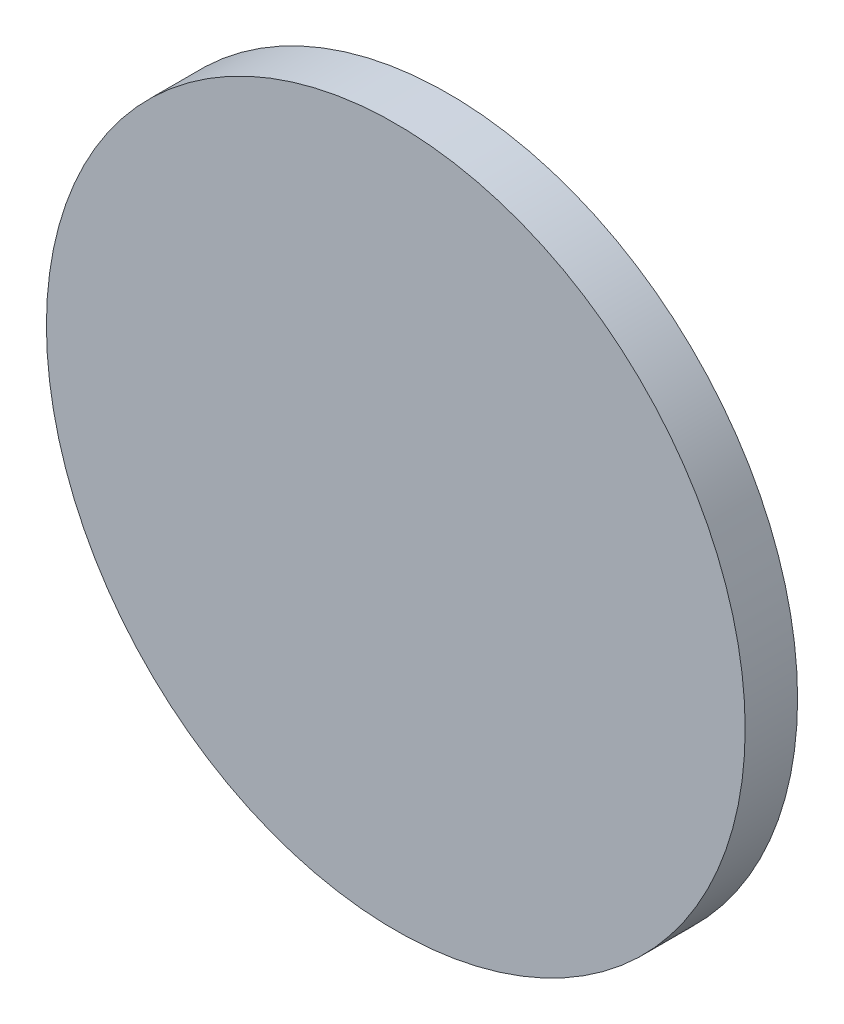
ISO-10303-21;
HEADER;
FILE_DESCRIPTION(('STEP AP214'),'2;1');
FILE_NAME('part.step','',(''),(''),'','','');
FILE_SCHEMA(('AUTOMOTIVE_DESIGN { 1 0 10303 214 1 1 1 1 }'));
ENDSEC;
DATA;
#1=APPLICATION_CONTEXT('core data for automotive mechanical design processes');
#2=APPLICATION_PROTOCOL_DEFINITION('international standard','automotive_design',2000,#1);
#3=PRODUCT_CONTEXT('',#1,'mechanical');
#4=PRODUCT('Part','Part','',(#3));
#5=PRODUCT_RELATED_PRODUCT_CATEGORY('part','',(#4));
#6=PRODUCT_DEFINITION_FORMATION('','',#4);
#7=PRODUCT_DEFINITION_CONTEXT('part definition',#1,'design');
#8=PRODUCT_DEFINITION('design','',#6,#7);
#9=PRODUCT_DEFINITION_SHAPE('','',#8);
#10=(LENGTH_UNIT() NAMED_UNIT(*) SI_UNIT(.MILLI.,.METRE.));
#11=(NAMED_UNIT(*) PLANE_ANGLE_UNIT() SI_UNIT($,.RADIAN.));
#12=(NAMED_UNIT(*) SI_UNIT($,.STERADIAN.) SOLID_ANGLE_UNIT());
#13=UNCERTAINTY_MEASURE_WITH_UNIT(LENGTH_MEASURE(1.E-05),#10,'distance_accuracy_value','');
#14=(GEOMETRIC_REPRESENTATION_CONTEXT(3) GLOBAL_UNCERTAINTY_ASSIGNED_CONTEXT((#13)) GLOBAL_UNIT_ASSIGNED_CONTEXT((#10,
#11,#12)) REPRESENTATION_CONTEXT('',''));
#15=CARTESIAN_POINT('',(0.,0.,0.));
#16=DIRECTION('',(0.,0.,1.));
#17=DIRECTION('',(1.,0.,0.));
#18=AXIS2_PLACEMENT_3D('',#15,#16,#17);
#19=CARTESIAN_POINT('',(10.44416,16.03491,0.76487));
#20=DIRECTION('',(0.,0.,-1.));
#21=DIRECTION('',(-1.,0.,0.));
#22=AXIS2_PLACEMENT_3D('',#19,#20,#21);
#23=PLANE('',#22);
#24=CARTESIAN_POINT('',(10.44416,16.03491,0.76487));
#25=DIRECTION('',(0.,0.,1.));
#26=DIRECTION('',(1.,0.,0.));
#27=AXIS2_PLACEMENT_3D('',#24,#25,#26);
#28=CIRCLE('',#27,0.2286);
#29=CARTESIAN_POINT('',(10.67276,16.03491,0.76487));
#30=VERTEX_POINT('',#29);
#31=EDGE_CURVE('E18',#30,#30,#28,.T.);
#32=ORIENTED_EDGE('',*,*,#31,.F.);
#33=EDGE_LOOP('',(#32));
#34=FACE_BOUND('',#33,.T.);
#35=ADVANCED_FACE('F15',(#34),#23,.T.);
#36=CARTESIAN_POINT('',(10.44416,16.03491,0.76487));
#37=DIRECTION('',(0.,0.,1.));
#38=DIRECTION('',(1.,0.,0.));
#39=AXIS2_PLACEMENT_3D('',#36,#37,#38);
#40=CYLINDRICAL_SURFACE('',#39,0.2286);
#41=CARTESIAN_POINT('',(10.44416,16.03491,0.79916));
#42=DIRECTION('',(0.,0.,1.));
#43=DIRECTION('',(1.,0.,0.));
#44=AXIS2_PLACEMENT_3D('',#41,#42,#43);
#45=CIRCLE('',#44,0.2286);
#46=CARTESIAN_POINT('',(10.67276,16.03491,0.79916));
#47=VERTEX_POINT('',#46);
#48=EDGE_CURVE('E10',#47,#47,#45,.T.);
#49=ORIENTED_EDGE('',*,*,#48,.F.);
#50=EDGE_LOOP('',(#49));
#51=FACE_BOUND('',#50,.T.);
#52=ORIENTED_EDGE('',*,*,#31,.T.);
#53=EDGE_LOOP('',(#52));
#54=FACE_BOUND('',#53,.T.);
#55=ADVANCED_FACE('F27',(#51,#54),#40,.T.);
#56=CARTESIAN_POINT('',(10.44416,16.03491,0.79916));
#57=DIRECTION('',(0.,0.,1.));
#58=DIRECTION('',(1.,0.,0.));
#59=AXIS2_PLACEMENT_3D('',#56,#57,#58);
#60=PLANE('',#59);
#61=ORIENTED_EDGE('',*,*,#48,.T.);
#62=EDGE_LOOP('',(#61));
#63=FACE_BOUND('',#62,.T.);
#64=ADVANCED_FACE('F34',(#63),#60,.T.);
#65=CLOSED_SHELL('',(#35,#55,#64));
#66=MANIFOLD_SOLID_BREP('B1',#65);
#67=ADVANCED_BREP_SHAPE_REPRESENTATION('',(#18,#66),#14);
#68=SHAPE_DEFINITION_REPRESENTATION(#9,#67);
ENDSEC;
END-ISO-10303-21;
